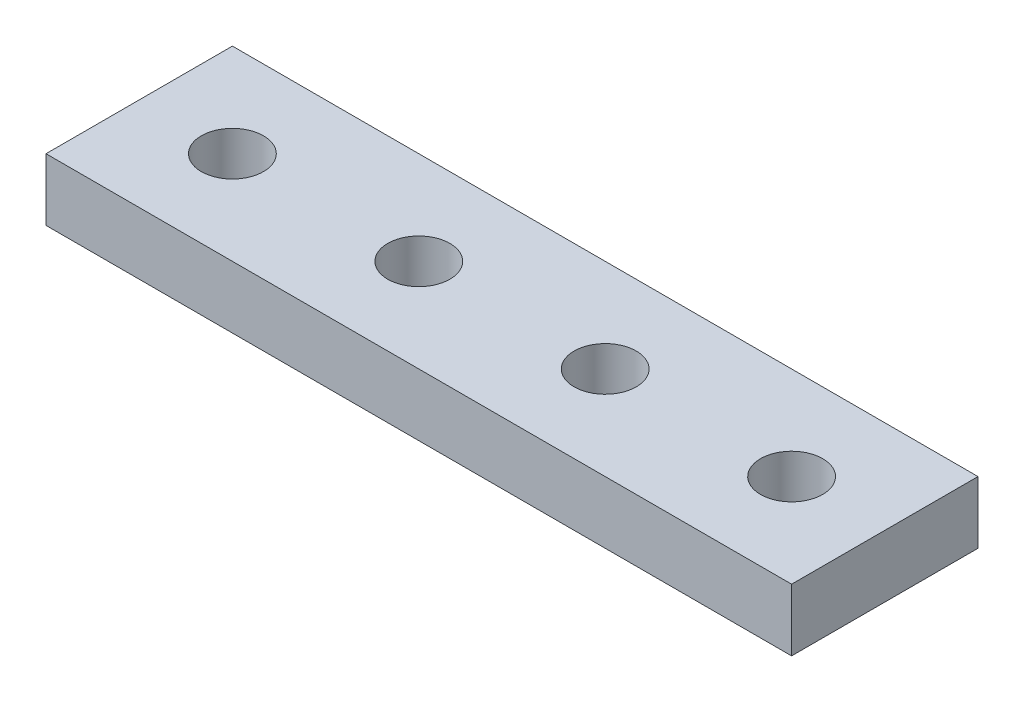
ISO-10303-21;
HEADER;
FILE_DESCRIPTION(('STEP AP214'),'2;1');
FILE_NAME('part.step','',(''),(''),'','','');
FILE_SCHEMA(('AUTOMOTIVE_DESIGN { 1 0 10303 214 1 1 1 1 }'));
ENDSEC;
DATA;
#1=APPLICATION_CONTEXT('core data for automotive mechanical design processes');
#2=APPLICATION_PROTOCOL_DEFINITION('international standard','automotive_design',2000,#1);
#3=PRODUCT_CONTEXT('',#1,'mechanical');
#4=PRODUCT('Part','Part','',(#3));
#5=PRODUCT_RELATED_PRODUCT_CATEGORY('part','',(#4));
#6=PRODUCT_DEFINITION_FORMATION('','',#4);
#7=PRODUCT_DEFINITION_CONTEXT('part definition',#1,'design');
#8=PRODUCT_DEFINITION('design','',#6,#7);
#9=PRODUCT_DEFINITION_SHAPE('','',#8);
#10=(LENGTH_UNIT() NAMED_UNIT(*) SI_UNIT(.MILLI.,.METRE.));
#11=(NAMED_UNIT(*) PLANE_ANGLE_UNIT() SI_UNIT($,.RADIAN.));
#12=(NAMED_UNIT(*) SI_UNIT($,.STERADIAN.) SOLID_ANGLE_UNIT());
#13=UNCERTAINTY_MEASURE_WITH_UNIT(LENGTH_MEASURE(1.E-05),#10,'distance_accuracy_value','');
#14=(GEOMETRIC_REPRESENTATION_CONTEXT(3) GLOBAL_UNCERTAINTY_ASSIGNED_CONTEXT((#13)) GLOBAL_UNIT_ASSIGNED_CONTEXT((#10,
#11,#12)) REPRESENTATION_CONTEXT('',''));
#15=CARTESIAN_POINT('',(0.,0.,0.));
#16=DIRECTION('',(0.,0.,1.));
#17=DIRECTION('',(1.,0.,0.));
#18=AXIS2_PLACEMENT_3D('',#15,#16,#17);
#19=CARTESIAN_POINT('',(60.,10.,15.));
#20=DIRECTION('',(-1.,0.,0.));
#21=DIRECTION('',(0.,0.,1.));
#22=AXIS2_PLACEMENT_3D('',#19,#20,#21);
#23=PLANE('',#22);
#24=DIRECTION('',(0.,0.,-1.));
#25=VECTOR('',#24,1.);
#26=CARTESIAN_POINT('',(60.,0.,15.));
#27=LINE('',#26,#25);
#28=CARTESIAN_POINT('',(60.,0.,15.));
#29=VERTEX_POINT('',#28);
#30=CARTESIAN_POINT('',(60.,0.,-15.));
#31=VERTEX_POINT('',#30);
#32=EDGE_CURVE('E102',#29,#31,#27,.T.);
#33=ORIENTED_EDGE('',*,*,#32,.T.);
#34=DIRECTION('',(0.,-1.,0.));
#35=VECTOR('',#34,1.);
#36=CARTESIAN_POINT('',(60.,10.,-15.));
#37=LINE('',#36,#35);
#38=CARTESIAN_POINT('',(60.,10.,-15.));
#39=VERTEX_POINT('',#38);
#40=EDGE_CURVE('E11',#39,#31,#37,.T.);
#41=ORIENTED_EDGE('',*,*,#40,.F.);
#42=DIRECTION('',(0.,0.,-1.));
#43=VECTOR('',#42,1.);
#44=CARTESIAN_POINT('',(60.,10.,15.));
#45=LINE('',#44,#43);
#46=CARTESIAN_POINT('',(60.,10.,15.));
#47=VERTEX_POINT('',#46);
#48=EDGE_CURVE('E90',#47,#39,#45,.T.);
#49=ORIENTED_EDGE('',*,*,#48,.F.);
#50=DIRECTION('',(0.,-1.,0.));
#51=VECTOR('',#50,1.);
#52=CARTESIAN_POINT('',(60.,10.,15.));
#53=LINE('',#52,#51);
#54=EDGE_CURVE('E98',#47,#29,#53,.T.);
#55=ORIENTED_EDGE('',*,*,#54,.T.);
#56=EDGE_LOOP('',(#33,#41,#49,#55));
#57=FACE_BOUND('',#56,.T.);
#58=ADVANCED_FACE('F39',(#57),#23,.F.);
#59=CARTESIAN_POINT('',(-60.,10.,-15.));
#60=DIRECTION('',(0.,0.,1.));
#61=DIRECTION('',(1.,0.,0.));
#62=AXIS2_PLACEMENT_3D('',#59,#60,#61);
#63=PLANE('',#62);
#64=DIRECTION('',(-1.,0.,0.));
#65=VECTOR('',#64,1.);
#66=CARTESIAN_POINT('',(-60.,0.,-15.));
#67=LINE('',#66,#65);
#68=CARTESIAN_POINT('',(-60.,0.,-15.));
#69=VERTEX_POINT('',#68);
#70=EDGE_CURVE('E94',#31,#69,#67,.T.);
#71=ORIENTED_EDGE('',*,*,#70,.T.);
#72=DIRECTION('',(0.,-1.,0.));
#73=VECTOR('',#72,1.);
#74=CARTESIAN_POINT('',(-60.,10.,-15.));
#75=LINE('',#74,#73);
#76=CARTESIAN_POINT('',(-60.,10.,-15.));
#77=VERTEX_POINT('',#76);
#78=EDGE_CURVE('E47',#77,#69,#75,.T.);
#79=ORIENTED_EDGE('',*,*,#78,.F.);
#80=DIRECTION('',(-1.,0.,0.));
#81=VECTOR('',#80,1.);
#82=CARTESIAN_POINT('',(-60.,10.,-15.));
#83=LINE('',#82,#81);
#84=EDGE_CURVE('E85',#39,#77,#83,.T.);
#85=ORIENTED_EDGE('',*,*,#84,.F.);
#86=ORIENTED_EDGE('',*,*,#40,.T.);
#87=EDGE_LOOP('',(#71,#79,#85,#86));
#88=FACE_BOUND('',#87,.T.);
#89=ADVANCED_FACE('F93',(#88),#63,.F.);
#90=CARTESIAN_POINT('',(-60.,10.,15.));
#91=DIRECTION('',(1.,0.,0.));
#92=DIRECTION('',(0.,0.,-1.));
#93=AXIS2_PLACEMENT_3D('',#90,#91,#92);
#94=PLANE('',#93);
#95=DIRECTION('',(0.,0.,1.));
#96=VECTOR('',#95,1.);
#97=CARTESIAN_POINT('',(-60.,0.,15.));
#98=LINE('',#97,#96);
#99=CARTESIAN_POINT('',(-60.,0.,15.));
#100=VERTEX_POINT('',#99);
#101=EDGE_CURVE('E72',#69,#100,#98,.T.);
#102=ORIENTED_EDGE('',*,*,#101,.T.);
#103=DIRECTION('',(0.,-1.,0.));
#104=VECTOR('',#103,1.);
#105=CARTESIAN_POINT('',(-60.,10.,15.));
#106=LINE('',#105,#104);
#107=CARTESIAN_POINT('',(-60.,10.,15.));
#108=VERTEX_POINT('',#107);
#109=EDGE_CURVE('E95',#108,#100,#106,.T.);
#110=ORIENTED_EDGE('',*,*,#109,.F.);
#111=DIRECTION('',(0.,0.,1.));
#112=VECTOR('',#111,1.);
#113=CARTESIAN_POINT('',(-60.,10.,15.));
#114=LINE('',#113,#112);
#115=EDGE_CURVE('E88',#77,#108,#114,.T.);
#116=ORIENTED_EDGE('',*,*,#115,.F.);
#117=ORIENTED_EDGE('',*,*,#78,.T.);
#118=EDGE_LOOP('',(#102,#110,#116,#117));
#119=FACE_BOUND('',#118,.T.);
#120=ADVANCED_FACE('F96',(#119),#94,.F.);
#121=CARTESIAN_POINT('',(-60.,10.,15.));
#122=DIRECTION('',(0.,0.,-1.));
#123=DIRECTION('',(-1.,0.,0.));
#124=AXIS2_PLACEMENT_3D('',#121,#122,#123);
#125=PLANE('',#124);
#126=DIRECTION('',(1.,0.,0.));
#127=VECTOR('',#126,1.);
#128=CARTESIAN_POINT('',(-60.,0.,15.));
#129=LINE('',#128,#127);
#130=EDGE_CURVE('E78',#100,#29,#129,.T.);
#131=ORIENTED_EDGE('',*,*,#130,.T.);
#132=ORIENTED_EDGE('',*,*,#54,.F.);
#133=DIRECTION('',(1.,0.,0.));
#134=VECTOR('',#133,1.);
#135=CARTESIAN_POINT('',(-60.,10.,15.));
#136=LINE('',#135,#134);
#137=EDGE_CURVE('E55',#108,#47,#136,.T.);
#138=ORIENTED_EDGE('',*,*,#137,.F.);
#139=ORIENTED_EDGE('',*,*,#109,.T.);
#140=EDGE_LOOP('',(#131,#132,#138,#139));
#141=FACE_BOUND('',#140,.T.);
#142=ADVANCED_FACE('F110',(#141),#125,.F.);
#143=CARTESIAN_POINT('',(0.,10.,0.));
#144=DIRECTION('',(0.,-1.,0.));
#145=DIRECTION('',(0.,0.,-1.));
#146=AXIS2_PLACEMENT_3D('',#143,#144,#145);
#147=PLANE('',#146);
#148=CARTESIAN_POINT('',(-45.,10.,0.));
#149=DIRECTION('',(0.,1.,0.));
#150=DIRECTION('',(0.,0.,1.));
#151=AXIS2_PLACEMENT_3D('',#148,#149,#150);
#152=CIRCLE('',#151,5.);
#153=CARTESIAN_POINT('',(-45.,10.,5.));
#154=VERTEX_POINT('',#153);
#155=EDGE_CURVE('E134',#154,#154,#152,.T.);
#156=ORIENTED_EDGE('',*,*,#155,.F.);
#157=EDGE_LOOP('',(#156));
#158=FACE_BOUND('',#157,.T.);
#159=CARTESIAN_POINT('',(-15.,10.,0.));
#160=DIRECTION('',(0.,1.,0.));
#161=DIRECTION('',(0.,0.,1.));
#162=AXIS2_PLACEMENT_3D('',#159,#160,#161);
#163=CIRCLE('',#162,5.);
#164=CARTESIAN_POINT('',(-15.,10.,5.));
#165=VERTEX_POINT('',#164);
#166=EDGE_CURVE('E128',#165,#165,#163,.T.);
#167=ORIENTED_EDGE('',*,*,#166,.F.);
#168=EDGE_LOOP('',(#167));
#169=FACE_BOUND('',#168,.T.);
#170=CARTESIAN_POINT('',(15.,10.,0.));
#171=DIRECTION('',(0.,1.,0.));
#172=DIRECTION('',(0.,0.,1.));
#173=AXIS2_PLACEMENT_3D('',#170,#171,#172);
#174=CIRCLE('',#173,5.);
#175=CARTESIAN_POINT('',(15.,10.,5.));
#176=VERTEX_POINT('',#175);
#177=EDGE_CURVE('E122',#176,#176,#174,.T.);
#178=ORIENTED_EDGE('',*,*,#177,.F.);
#179=EDGE_LOOP('',(#178));
#180=FACE_BOUND('',#179,.T.);
#181=CARTESIAN_POINT('',(45.,10.,0.));
#182=DIRECTION('',(0.,1.,0.));
#183=DIRECTION('',(0.,0.,1.));
#184=AXIS2_PLACEMENT_3D('',#181,#182,#183);
#185=CIRCLE('',#184,5.);
#186=CARTESIAN_POINT('',(45.,10.,5.));
#187=VERTEX_POINT('',#186);
#188=EDGE_CURVE('E116',#187,#187,#185,.T.);
#189=ORIENTED_EDGE('',*,*,#188,.F.);
#190=EDGE_LOOP('',(#189));
#191=FACE_BOUND('',#190,.T.);
#192=ORIENTED_EDGE('',*,*,#48,.T.);
#193=ORIENTED_EDGE('',*,*,#84,.T.);
#194=ORIENTED_EDGE('',*,*,#115,.T.);
#195=ORIENTED_EDGE('',*,*,#137,.T.);
#196=EDGE_LOOP('',(#192,#193,#194,#195));
#197=FACE_BOUND('',#196,.T.);
#198=ADVANCED_FACE('F86',(#158,#169,#180,#191,#197),#147,.F.);
#199=CARTESIAN_POINT('',(0.,0.,0.));
#200=DIRECTION('',(0.,-1.,0.));
#201=DIRECTION('',(0.,0.,-1.));
#202=AXIS2_PLACEMENT_3D('',#199,#200,#201);
#203=PLANE('',#202);
#204=CARTESIAN_POINT('',(-45.,0.,0.));
#205=DIRECTION('',(0.,1.,0.));
#206=DIRECTION('',(0.,0.,1.));
#207=AXIS2_PLACEMENT_3D('',#204,#205,#206);
#208=CIRCLE('',#207,5.);
#209=CARTESIAN_POINT('',(-45.,0.,5.));
#210=VERTEX_POINT('',#209);
#211=EDGE_CURVE('E105',#210,#210,#208,.T.);
#212=ORIENTED_EDGE('',*,*,#211,.T.);
#213=EDGE_LOOP('',(#212));
#214=FACE_BOUND('',#213,.T.);
#215=CARTESIAN_POINT('',(-15.,0.,0.));
#216=DIRECTION('',(0.,1.,0.));
#217=DIRECTION('',(0.,0.,1.));
#218=AXIS2_PLACEMENT_3D('',#215,#216,#217);
#219=CIRCLE('',#218,5.);
#220=CARTESIAN_POINT('',(-15.,0.,5.));
#221=VERTEX_POINT('',#220);
#222=EDGE_CURVE('E131',#221,#221,#219,.T.);
#223=ORIENTED_EDGE('',*,*,#222,.T.);
#224=EDGE_LOOP('',(#223));
#225=FACE_BOUND('',#224,.T.);
#226=CARTESIAN_POINT('',(15.,0.,0.));
#227=DIRECTION('',(0.,1.,0.));
#228=DIRECTION('',(0.,0.,1.));
#229=AXIS2_PLACEMENT_3D('',#226,#227,#228);
#230=CIRCLE('',#229,5.);
#231=CARTESIAN_POINT('',(15.,0.,5.));
#232=VERTEX_POINT('',#231);
#233=EDGE_CURVE('E125',#232,#232,#230,.T.);
#234=ORIENTED_EDGE('',*,*,#233,.T.);
#235=EDGE_LOOP('',(#234));
#236=FACE_BOUND('',#235,.T.);
#237=CARTESIAN_POINT('',(45.,0.,0.));
#238=DIRECTION('',(0.,1.,0.));
#239=DIRECTION('',(0.,0.,1.));
#240=AXIS2_PLACEMENT_3D('',#237,#238,#239);
#241=CIRCLE('',#240,5.);
#242=CARTESIAN_POINT('',(45.,0.,5.));
#243=VERTEX_POINT('',#242);
#244=EDGE_CURVE('E119',#243,#243,#241,.T.);
#245=ORIENTED_EDGE('',*,*,#244,.T.);
#246=EDGE_LOOP('',(#245));
#247=FACE_BOUND('',#246,.T.);
#248=ORIENTED_EDGE('',*,*,#32,.F.);
#249=ORIENTED_EDGE('',*,*,#130,.F.);
#250=ORIENTED_EDGE('',*,*,#101,.F.);
#251=ORIENTED_EDGE('',*,*,#70,.F.);
#252=EDGE_LOOP('',(#248,#249,#250,#251));
#253=FACE_BOUND('',#252,.T.);
#254=ADVANCED_FACE('F113',(#214,#225,#236,#247,#253),#203,.T.);
#255=CARTESIAN_POINT('',(45.,0.,0.));
#256=DIRECTION('',(0.,1.,0.));
#257=DIRECTION('',(0.,0.,1.));
#258=AXIS2_PLACEMENT_3D('',#255,#256,#257);
#259=CYLINDRICAL_SURFACE('',#258,5.);
#260=ORIENTED_EDGE('',*,*,#244,.F.);
#261=EDGE_LOOP('',(#260));
#262=FACE_BOUND('',#261,.T.);
#263=ORIENTED_EDGE('',*,*,#188,.T.);
#264=EDGE_LOOP('',(#263));
#265=FACE_BOUND('',#264,.T.);
#266=ADVANCED_FACE('F158',(#262,#265),#259,.F.);
#267=CARTESIAN_POINT('',(15.,0.,0.));
#268=DIRECTION('',(0.,1.,0.));
#269=DIRECTION('',(0.,0.,1.));
#270=AXIS2_PLACEMENT_3D('',#267,#268,#269);
#271=CYLINDRICAL_SURFACE('',#270,5.);
#272=ORIENTED_EDGE('',*,*,#233,.F.);
#273=EDGE_LOOP('',(#272));
#274=FACE_BOUND('',#273,.T.);
#275=ORIENTED_EDGE('',*,*,#177,.T.);
#276=EDGE_LOOP('',(#275));
#277=FACE_BOUND('',#276,.T.);
#278=ADVANCED_FACE('F160',(#274,#277),#271,.F.);
#279=CARTESIAN_POINT('',(-15.,0.,0.));
#280=DIRECTION('',(0.,1.,0.));
#281=DIRECTION('',(0.,0.,1.));
#282=AXIS2_PLACEMENT_3D('',#279,#280,#281);
#283=CYLINDRICAL_SURFACE('',#282,5.);
#284=ORIENTED_EDGE('',*,*,#222,.F.);
#285=EDGE_LOOP('',(#284));
#286=FACE_BOUND('',#285,.T.);
#287=ORIENTED_EDGE('',*,*,#166,.T.);
#288=EDGE_LOOP('',(#287));
#289=FACE_BOUND('',#288,.T.);
#290=ADVANCED_FACE('F145',(#286,#289),#283,.F.);
#291=CARTESIAN_POINT('',(-45.,0.,0.));
#292=DIRECTION('',(0.,1.,0.));
#293=DIRECTION('',(0.,0.,1.));
#294=AXIS2_PLACEMENT_3D('',#291,#292,#293);
#295=CYLINDRICAL_SURFACE('',#294,5.);
#296=ORIENTED_EDGE('',*,*,#211,.F.);
#297=EDGE_LOOP('',(#296));
#298=FACE_BOUND('',#297,.T.);
#299=ORIENTED_EDGE('',*,*,#155,.T.);
#300=EDGE_LOOP('',(#299));
#301=FACE_BOUND('',#300,.T.);
#302=ADVANCED_FACE('F142',(#298,#301),#295,.F.);
#303=CLOSED_SHELL('',(#58,#89,#120,#142,#198,#254,#266,#278,#290,#302));
#304=MANIFOLD_SOLID_BREP('B2',#303);
#305=ADVANCED_BREP_SHAPE_REPRESENTATION('',(#18,#304),#14);
#306=SHAPE_DEFINITION_REPRESENTATION(#9,#305);
ENDSEC;
END-ISO-10303-21;
